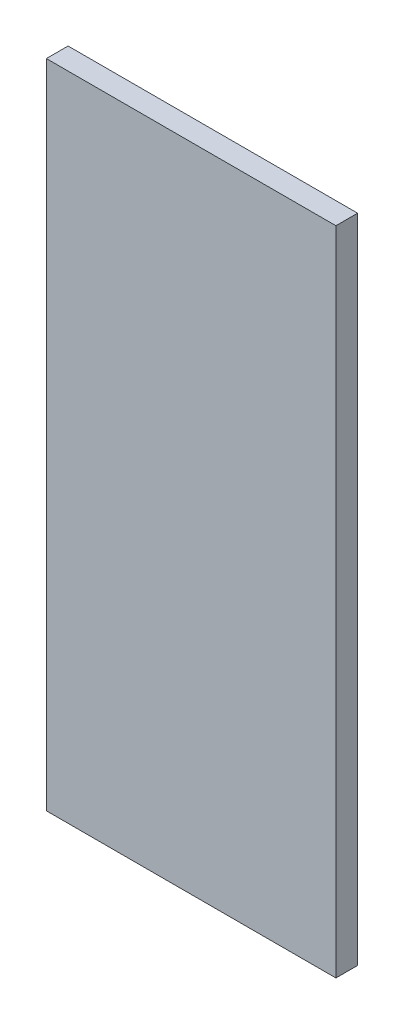
ISO-10303-21;
HEADER;
FILE_DESCRIPTION(('STEP AP214'),'2;1');
FILE_NAME('part.step','',(''),(''),'','','');
FILE_SCHEMA(('AUTOMOTIVE_DESIGN { 1 0 10303 214 1 1 1 1 }'));
ENDSEC;
DATA;
#1=APPLICATION_CONTEXT('core data for automotive mechanical design processes');
#2=APPLICATION_PROTOCOL_DEFINITION('international standard','automotive_design',2000,#1);
#3=PRODUCT_CONTEXT('',#1,'mechanical');
#4=PRODUCT('Part','Part','',(#3));
#5=PRODUCT_RELATED_PRODUCT_CATEGORY('part','',(#4));
#6=PRODUCT_DEFINITION_FORMATION('','',#4);
#7=PRODUCT_DEFINITION_CONTEXT('part definition',#1,'design');
#8=PRODUCT_DEFINITION('design','',#6,#7);
#9=PRODUCT_DEFINITION_SHAPE('','',#8);
#10=(LENGTH_UNIT() NAMED_UNIT(*) SI_UNIT(.MILLI.,.METRE.));
#11=(NAMED_UNIT(*) PLANE_ANGLE_UNIT() SI_UNIT($,.RADIAN.));
#12=(NAMED_UNIT(*) SI_UNIT($,.STERADIAN.) SOLID_ANGLE_UNIT());
#13=UNCERTAINTY_MEASURE_WITH_UNIT(LENGTH_MEASURE(1.E-05),#10,'distance_accuracy_value','');
#14=(GEOMETRIC_REPRESENTATION_CONTEXT(3) GLOBAL_UNCERTAINTY_ASSIGNED_CONTEXT((#13)) GLOBAL_UNIT_ASSIGNED_CONTEXT((#10,
#11,#12)) REPRESENTATION_CONTEXT('',''));
#15=CARTESIAN_POINT('',(0.,0.,0.));
#16=DIRECTION('',(0.,0.,1.));
#17=DIRECTION('',(1.,0.,0.));
#18=AXIS2_PLACEMENT_3D('',#15,#16,#17);
#19=CARTESIAN_POINT('',(0.,0.,3.));
#20=DIRECTION('',(1.,0.,0.));
#21=DIRECTION('',(0.,1.,0.));
#22=AXIS2_PLACEMENT_3D('',#19,#20,#21);
#23=PLANE('',#22);
#24=DIRECTION('',(0.,-1.,0.));
#25=VECTOR('',#24,1.);
#26=CARTESIAN_POINT('',(0.,0.,0.));
#27=LINE('',#26,#25);
#28=CARTESIAN_POINT('',(0.,0.,0.));
#29=VERTEX_POINT('',#28);
#30=CARTESIAN_POINT('',(0.,-90.,0.));
#31=VERTEX_POINT('',#30);
#32=EDGE_CURVE('E96',#29,#31,#27,.T.);
#33=ORIENTED_EDGE('',*,*,#32,.T.);
#34=DIRECTION('',(0.,0.,-1.));
#35=VECTOR('',#34,1.);
#36=CARTESIAN_POINT('',(0.,-90.,3.));
#37=LINE('',#36,#35);
#38=CARTESIAN_POINT('',(0.,-90.,3.));
#39=VERTEX_POINT('',#38);
#40=EDGE_CURVE('E11',#39,#31,#37,.T.);
#41=ORIENTED_EDGE('',*,*,#40,.F.);
#42=DIRECTION('',(0.,-1.,0.));
#43=VECTOR('',#42,1.);
#44=CARTESIAN_POINT('',(0.,0.,3.));
#45=LINE('',#44,#43);
#46=CARTESIAN_POINT('',(0.,0.,3.));
#47=VERTEX_POINT('',#46);
#48=EDGE_CURVE('E84',#47,#39,#45,.T.);
#49=ORIENTED_EDGE('',*,*,#48,.F.);
#50=DIRECTION('',(0.,0.,-1.));
#51=VECTOR('',#50,1.);
#52=CARTESIAN_POINT('',(0.,0.,3.));
#53=LINE('',#52,#51);
#54=EDGE_CURVE('E92',#47,#29,#53,.T.);
#55=ORIENTED_EDGE('',*,*,#54,.T.);
#56=EDGE_LOOP('',(#33,#41,#49,#55));
#57=FACE_BOUND('',#56,.T.);
#58=ADVANCED_FACE('F33',(#57),#23,.F.);
#59=CARTESIAN_POINT('',(0.,-90.,3.));
#60=DIRECTION('',(0.,1.,0.));
#61=DIRECTION('',(0.,0.,1.));
#62=AXIS2_PLACEMENT_3D('',#59,#60,#61);
#63=PLANE('',#62);
#64=DIRECTION('',(1.,0.,0.));
#65=VECTOR('',#64,1.);
#66=CARTESIAN_POINT('',(0.,-90.,0.));
#67=LINE('',#66,#65);
#68=CARTESIAN_POINT('',(40.,-90.,0.));
#69=VERTEX_POINT('',#68);
#70=EDGE_CURVE('E88',#31,#69,#67,.T.);
#71=ORIENTED_EDGE('',*,*,#70,.T.);
#72=DIRECTION('',(0.,0.,-1.));
#73=VECTOR('',#72,1.);
#74=CARTESIAN_POINT('',(40.,-90.,3.));
#75=LINE('',#74,#73);
#76=CARTESIAN_POINT('',(40.,-90.,3.));
#77=VERTEX_POINT('',#76);
#78=EDGE_CURVE('E41',#77,#69,#75,.T.);
#79=ORIENTED_EDGE('',*,*,#78,.F.);
#80=DIRECTION('',(1.,0.,0.));
#81=VECTOR('',#80,1.);
#82=CARTESIAN_POINT('',(0.,-90.,3.));
#83=LINE('',#82,#81);
#84=EDGE_CURVE('E79',#39,#77,#83,.T.);
#85=ORIENTED_EDGE('',*,*,#84,.F.);
#86=ORIENTED_EDGE('',*,*,#40,.T.);
#87=EDGE_LOOP('',(#71,#79,#85,#86));
#88=FACE_BOUND('',#87,.T.);
#89=ADVANCED_FACE('F87',(#88),#63,.F.);
#90=CARTESIAN_POINT('',(40.,0.,3.));
#91=DIRECTION('',(-1.,0.,0.));
#92=DIRECTION('',(0.,-1.,0.));
#93=AXIS2_PLACEMENT_3D('',#90,#91,#92);
#94=PLANE('',#93);
#95=DIRECTION('',(0.,1.,0.));
#96=VECTOR('',#95,1.);
#97=CARTESIAN_POINT('',(40.,0.,0.));
#98=LINE('',#97,#96);
#99=CARTESIAN_POINT('',(40.,0.,0.));
#100=VERTEX_POINT('',#99);
#101=EDGE_CURVE('E66',#69,#100,#98,.T.);
#102=ORIENTED_EDGE('',*,*,#101,.T.);
#103=DIRECTION('',(0.,0.,-1.));
#104=VECTOR('',#103,1.);
#105=CARTESIAN_POINT('',(40.,0.,3.));
#106=LINE('',#105,#104);
#107=CARTESIAN_POINT('',(40.,0.,3.));
#108=VERTEX_POINT('',#107);
#109=EDGE_CURVE('E89',#108,#100,#106,.T.);
#110=ORIENTED_EDGE('',*,*,#109,.F.);
#111=DIRECTION('',(0.,1.,0.));
#112=VECTOR('',#111,1.);
#113=CARTESIAN_POINT('',(40.,0.,3.));
#114=LINE('',#113,#112);
#115=EDGE_CURVE('E82',#77,#108,#114,.T.);
#116=ORIENTED_EDGE('',*,*,#115,.F.);
#117=ORIENTED_EDGE('',*,*,#78,.T.);
#118=EDGE_LOOP('',(#102,#110,#116,#117));
#119=FACE_BOUND('',#118,.T.);
#120=ADVANCED_FACE('F90',(#119),#94,.F.);
#121=CARTESIAN_POINT('',(0.,0.,3.));
#122=DIRECTION('',(0.,-1.,0.));
#123=DIRECTION('',(0.,0.,-1.));
#124=AXIS2_PLACEMENT_3D('',#121,#122,#123);
#125=PLANE('',#124);
#126=DIRECTION('',(-1.,0.,0.));
#127=VECTOR('',#126,1.);
#128=CARTESIAN_POINT('',(0.,0.,0.));
#129=LINE('',#128,#127);
#130=EDGE_CURVE('E72',#100,#29,#129,.T.);
#131=ORIENTED_EDGE('',*,*,#130,.T.);
#132=ORIENTED_EDGE('',*,*,#54,.F.);
#133=DIRECTION('',(-1.,0.,0.));
#134=VECTOR('',#133,1.);
#135=CARTESIAN_POINT('',(0.,0.,3.));
#136=LINE('',#135,#134);
#137=EDGE_CURVE('E49',#108,#47,#136,.T.);
#138=ORIENTED_EDGE('',*,*,#137,.F.);
#139=ORIENTED_EDGE('',*,*,#109,.T.);
#140=EDGE_LOOP('',(#131,#132,#138,#139));
#141=FACE_BOUND('',#140,.T.);
#142=ADVANCED_FACE('F103',(#141),#125,.F.);
#143=CARTESIAN_POINT('',(0.,0.,3.));
#144=DIRECTION('',(0.,0.,1.));
#145=DIRECTION('',(1.,0.,0.));
#146=AXIS2_PLACEMENT_3D('',#143,#144,#145);
#147=PLANE('',#146);
#148=ORIENTED_EDGE('',*,*,#48,.T.);
#149=ORIENTED_EDGE('',*,*,#84,.T.);
#150=ORIENTED_EDGE('',*,*,#115,.T.);
#151=ORIENTED_EDGE('',*,*,#137,.T.);
#152=EDGE_LOOP('',(#148,#149,#150,#151));
#153=FACE_BOUND('',#152,.T.);
#154=ADVANCED_FACE('F80',(#153),#147,.T.);
#155=CARTESIAN_POINT('',(0.,0.,0.));
#156=DIRECTION('',(0.,0.,1.));
#157=DIRECTION('',(1.,0.,0.));
#158=AXIS2_PLACEMENT_3D('',#155,#156,#157);
#159=PLANE('',#158);
#160=ORIENTED_EDGE('',*,*,#32,.F.);
#161=ORIENTED_EDGE('',*,*,#130,.F.);
#162=ORIENTED_EDGE('',*,*,#101,.F.);
#163=ORIENTED_EDGE('',*,*,#70,.F.);
#164=EDGE_LOOP('',(#160,#161,#162,#163));
#165=FACE_BOUND('',#164,.T.);
#166=ADVANCED_FACE('F106',(#165),#159,.F.);
#167=CLOSED_SHELL('',(#58,#89,#120,#142,#154,#166));
#168=MANIFOLD_SOLID_BREP('B2',#167);
#169=ADVANCED_BREP_SHAPE_REPRESENTATION('',(#18,#168),#14);
#170=SHAPE_DEFINITION_REPRESENTATION(#9,#169);
ENDSEC;
END-ISO-10303-21;
